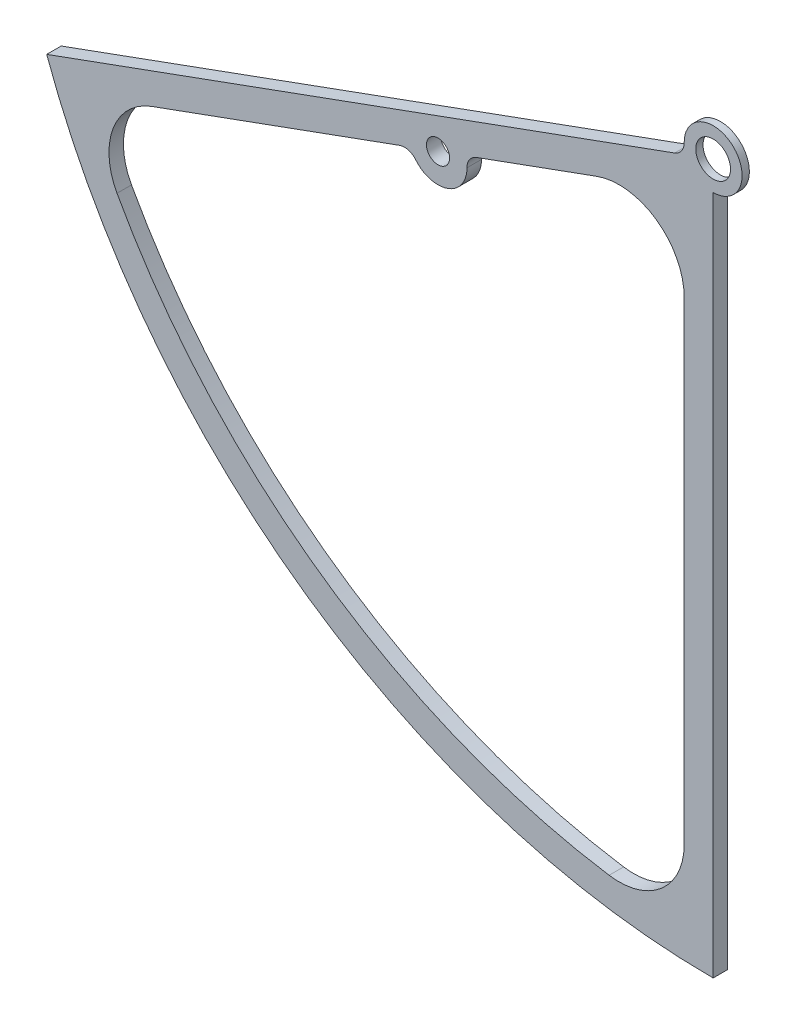
ISO-10303-21;
HEADER;
FILE_DESCRIPTION(('STEP AP214'),'2;1');
FILE_NAME('part.step','',(''),(''),'','','');
FILE_SCHEMA(('AUTOMOTIVE_DESIGN { 1 0 10303 214 1 1 1 1 }'));
ENDSEC;
DATA;
#1=APPLICATION_CONTEXT('core data for automotive mechanical design processes');
#2=APPLICATION_PROTOCOL_DEFINITION('international standard','automotive_design',2000,#1);
#3=PRODUCT_CONTEXT('',#1,'mechanical');
#4=PRODUCT('Part','Part','',(#3));
#5=PRODUCT_RELATED_PRODUCT_CATEGORY('part','',(#4));
#6=PRODUCT_DEFINITION_FORMATION('','',#4);
#7=PRODUCT_DEFINITION_CONTEXT('part definition',#1,'design');
#8=PRODUCT_DEFINITION('design','',#6,#7);
#9=PRODUCT_DEFINITION_SHAPE('','',#8);
#10=(LENGTH_UNIT() NAMED_UNIT(*) SI_UNIT(.MILLI.,.METRE.));
#11=(NAMED_UNIT(*) PLANE_ANGLE_UNIT() SI_UNIT($,.RADIAN.));
#12=(NAMED_UNIT(*) SI_UNIT($,.STERADIAN.) SOLID_ANGLE_UNIT());
#13=UNCERTAINTY_MEASURE_WITH_UNIT(LENGTH_MEASURE(1.E-05),#10,'distance_accuracy_value','');
#14=(GEOMETRIC_REPRESENTATION_CONTEXT(3) GLOBAL_UNCERTAINTY_ASSIGNED_CONTEXT((#13)) GLOBAL_UNIT_ASSIGNED_CONTEXT((#10,
#11,#12)) REPRESENTATION_CONTEXT('',''));
#15=CARTESIAN_POINT('',(0.,0.,0.));
#16=DIRECTION('',(0.,0.,1.));
#17=DIRECTION('',(1.,0.,0.));
#18=AXIS2_PLACEMENT_3D('',#15,#16,#17);
#19=CARTESIAN_POINT('',(0.,0.,10.));
#20=DIRECTION('',(0.,0.,-1.));
#21=DIRECTION('',(-1.,0.,0.));
#22=AXIS2_PLACEMENT_3D('',#19,#20,#21);
#23=CYLINDRICAL_SURFACE('',#22,20.);
#24=CARTESIAN_POINT('',(0.,0.,5.));
#25=DIRECTION('',(0.,0.,-1.));
#26=DIRECTION('',(-1.,0.,0.));
#27=AXIS2_PLACEMENT_3D('',#24,#25,#26);
#28=CIRCLE('',#27,20.);
#29=CARTESIAN_POINT('',(-19.9991482725358,-0.184576198706586,5.));
#30=VERTEX_POINT('',#29);
#31=CARTESIAN_POINT('',(0.,-20.,5.));
#32=VERTEX_POINT('',#31);
#33=EDGE_CURVE('E177',#30,#32,#28,.T.);
#34=ORIENTED_EDGE('',*,*,#33,.F.);
#35=DIRECTION('',(0.,0.,-1.));
#36=VECTOR('',#35,1.);
#37=CARTESIAN_POINT('',(-19.9991482725358,-0.184576198706586,10.));
#38=LINE('',#37,#36);
#39=CARTESIAN_POINT('',(-19.9991482725358,-0.184576198706586,10.));
#40=VERTEX_POINT('',#39);
#41=EDGE_CURVE('E257',#30,#40,#38,.F.);
#42=ORIENTED_EDGE('',*,*,#41,.T.);
#43=CARTESIAN_POINT('',(0.,0.,10.));
#44=DIRECTION('',(0.,0.,1.));
#45=DIRECTION('',(1.,0.,0.));
#46=AXIS2_PLACEMENT_3D('',#43,#44,#45);
#47=CIRCLE('',#46,20.);
#48=CARTESIAN_POINT('',(0.,-20.,10.));
#49=VERTEX_POINT('',#48);
#50=EDGE_CURVE('E287',#49,#40,#47,.T.);
#51=ORIENTED_EDGE('',*,*,#50,.F.);
#52=DIRECTION('',(0.,0.,-1.));
#53=VECTOR('',#52,1.);
#54=CARTESIAN_POINT('',(0.,-20.,10.));
#55=LINE('',#54,#53);
#56=EDGE_CURVE('E202',#49,#32,#55,.T.);
#57=ORIENTED_EDGE('',*,*,#56,.T.);
#58=EDGE_LOOP('',(#34,#42,#51,#57));
#59=FACE_BOUND('',#58,.T.);
#60=ADVANCED_FACE('F38',(#59),#23,.T.);
#61=CARTESIAN_POINT('',(0.,0.,10.));
#62=DIRECTION('',(0.,0.,-1.));
#63=DIRECTION('',(-1.,0.,0.));
#64=AXIS2_PLACEMENT_3D('',#61,#62,#63);
#65=CYLINDRICAL_SURFACE('',#64,12.);
#66=CARTESIAN_POINT('',(0.,0.,10.));
#67=DIRECTION('',(0.,0.,1.));
#68=DIRECTION('',(1.,0.,0.));
#69=AXIS2_PLACEMENT_3D('',#66,#67,#68);
#70=CIRCLE('',#69,12.);
#71=CARTESIAN_POINT('',(12.,0.,10.));
#72=VERTEX_POINT('',#71);
#73=EDGE_CURVE('E190',#72,#72,#70,.T.);
#74=ORIENTED_EDGE('',*,*,#73,.T.);
#75=EDGE_LOOP('',(#74));
#76=FACE_BOUND('',#75,.T.);
#77=CARTESIAN_POINT('',(0.,0.,5.));
#78=DIRECTION('',(0.,0.,-1.));
#79=DIRECTION('',(-1.,0.,0.));
#80=AXIS2_PLACEMENT_3D('',#77,#78,#79);
#81=CIRCLE('',#80,12.);
#82=CARTESIAN_POINT('',(-12.,0.,5.));
#83=VERTEX_POINT('',#82);
#84=EDGE_CURVE('E167',#83,#83,#81,.T.);
#85=ORIENTED_EDGE('',*,*,#84,.T.);
#86=EDGE_LOOP('',(#85));
#87=FACE_BOUND('',#86,.T.);
#88=ADVANCED_FACE('F378',(#76,#87),#65,.F.);
#89=CARTESIAN_POINT('',(0.,0.,10.));
#90=DIRECTION('',(0.,0.,1.));
#91=DIRECTION('',(1.,0.,0.));
#92=AXIS2_PLACEMENT_3D('',#89,#90,#91);
#93=PLANE('',#92);
#94=DIRECTION('',(0.,1.,0.));
#95=VECTOR('',#94,1.);
#96=CARTESIAN_POINT('',(-20.0000000000001,-28.5629601348423,10.));
#97=LINE('',#96,#95);
#98=CARTESIAN_POINT('',(-20.0000000000001,-420.,10.));
#99=VERTEX_POINT('',#98);
#100=CARTESIAN_POINT('',(-20.0000000000001,-92.8296204382372,10.));
#101=VERTEX_POINT('',#100);
#102=EDGE_CURVE('E333',#99,#101,#97,.T.);
#103=ORIENTED_EDGE('',*,*,#102,.F.);
#104=CARTESIAN_POINT('',(-65.0000000000001,-420.,10.));
#105=DIRECTION('',(0.,0.,1.));
#106=DIRECTION('',(1.,0.,0.));
#107=AXIS2_PLACEMENT_3D('',#104,#105,#106);
#108=CIRCLE('',#107,45.);
#109=CARTESIAN_POINT('',(-71.8823529411765,-464.470588235294,10.));
#110=VERTEX_POINT('',#109);
#111=EDGE_CURVE('E234',#99,#110,#108,.F.);
#112=ORIENTED_EDGE('',*,*,#111,.T.);
#113=CARTESIAN_POINT('',(0.,0.,10.));
#114=DIRECTION('',(0.,0.,1.));
#115=DIRECTION('',(1.,0.,0.));
#116=AXIS2_PLACEMENT_3D('',#113,#114,#115);
#117=CIRCLE('',#116,470.);
#118=CARTESIAN_POINT('',(-411.874371681269,-226.405613782344,10.));
#119=VERTEX_POINT('',#118);
#120=EDGE_CURVE('E306',#119,#110,#117,.T.);
#121=ORIENTED_EDGE('',*,*,#120,.F.);
#122=CARTESIAN_POINT('',(-372.439591413914,-204.728480547864,10.));
#123=DIRECTION('',(0.,0.,1.));
#124=DIRECTION('',(1.,0.,0.));
#125=AXIS2_PLACEMENT_3D('',#122,#123,#124);
#126=CIRCLE('',#125,45.);
#127=CARTESIAN_POINT('',(-387.830497863568,-162.442312612498,10.));
#128=VERTEX_POINT('',#127);
#129=EDGE_CURVE('E246',#119,#128,#126,.F.);
#130=ORIENTED_EDGE('',*,*,#129,.T.);
#131=DIRECTION('',(-0.939692620785909,-0.342020143325666,0.));
#132=VECTOR('',#131,1.);
#133=CARTESIAN_POINT('',(-208.888849531636,-97.3128789491445,10.));
#134=LINE('',#133,#132);
#135=CARTESIAN_POINT('',(-216.673518091464,-100.14626658855,10.));
#136=VERTEX_POINT('',#135);
#137=EDGE_CURVE('E302',#136,#128,#134,.T.);
#138=ORIENTED_EDGE('',*,*,#137,.F.);
#139=CARTESIAN_POINT('',(-213.253316658208,-109.543192796409,10.));
#140=DIRECTION('',(0.,0.,1.));
#141=DIRECTION('',(1.,0.,0.));
#142=AXIS2_PLACEMENT_3D('',#139,#140,#141);
#143=CIRCLE('',#142,10.);
#144=CARTESIAN_POINT('',(-205.533876810778,-103.18628722515,10.));
#145=VERTEX_POINT('',#144);
#146=EDGE_CURVE('E11',#136,#145,#143,.F.);
#147=ORIENTED_EDGE('',*,*,#146,.T.);
#148=CARTESIAN_POINT('',(-190.094997115917,-90.4724760826312,10.));
#149=DIRECTION('',(0.,0.,-1.));
#150=DIRECTION('',(1.,0.,0.));
#151=AXIS2_PLACEMENT_3D('',#148,#149,#150);
#152=CIRCLE('',#151,20.);
#153=CARTESIAN_POINT('',(-170.095848843382,-90.2878998839246,10.));
#154=VERTEX_POINT('',#153);
#155=EDGE_CURVE('E325',#154,#145,#152,.T.);
#156=ORIENTED_EDGE('',*,*,#155,.F.);
#157=CARTESIAN_POINT('',(-160.096274707114,-90.1956117845713,10.));
#158=DIRECTION('',(0.,0.,1.));
#159=DIRECTION('',(1.,0.,0.));
#160=AXIS2_PLACEMENT_3D('',#157,#158,#159);
#161=CIRCLE('',#160,10.);
#162=CARTESIAN_POINT('',(-163.51647614037,-80.7986855767122,10.));
#163=VERTEX_POINT('',#162);
#164=EDGE_CURVE('E282',#154,#163,#161,.F.);
#165=ORIENTED_EDGE('',*,*,#164,.T.);
#166=DIRECTION('',(-0.939692620785909,-0.342020143325666,0.));
#167=VECTOR('',#166,1.);
#168=CARTESIAN_POINT('',(-20.0000000000001,-28.5629601348423,10.));
#169=LINE('',#168,#167);
#170=CARTESIAN_POINT('',(-80.390906449655,-50.5434525028713,10.));
#171=VERTEX_POINT('',#170);
#172=EDGE_CURVE('E329',#171,#163,#169,.T.);
#173=ORIENTED_EDGE('',*,*,#172,.F.);
#174=CARTESIAN_POINT('',(-65.0000000000001,-92.8296204382372,10.));
#175=DIRECTION('',(0.,0.,1.));
#176=DIRECTION('',(1.,0.,0.));
#177=AXIS2_PLACEMENT_3D('',#174,#175,#176);
#178=CIRCLE('',#177,45.);
#179=EDGE_CURVE('E240',#171,#101,#178,.F.);
#180=ORIENTED_EDGE('',*,*,#179,.T.);
#181=EDGE_LOOP('',(#103,#112,#121,#130,#138,#147,#156,#165,#173,#180));
#182=FACE_BOUND('',#181,.T.);
#183=ORIENTED_EDGE('',*,*,#73,.F.);
#184=EDGE_LOOP('',(#183));
#185=FACE_BOUND('',#184,.T.);
#186=CARTESIAN_POINT('',(0.,0.,10.));
#187=DIRECTION('',(0.,0.,1.));
#188=DIRECTION('',(1.,0.,0.));
#189=AXIS2_PLACEMENT_3D('',#186,#187,#188);
#190=CIRCLE('',#189,490.);
#191=CARTESIAN_POINT('',(-460.449384185096,-167.589870229576,10.));
#192=VERTEX_POINT('',#191);
#193=CARTESIAN_POINT('',(0.,-490.,10.));
#194=VERTEX_POINT('',#193);
#195=EDGE_CURVE('E188',#192,#194,#190,.T.);
#196=ORIENTED_EDGE('',*,*,#195,.T.);
#197=DIRECTION('',(0.,1.,0.));
#198=VECTOR('',#197,1.);
#199=CARTESIAN_POINT('',(0.,-20.,10.));
#200=LINE('',#199,#198);
#201=EDGE_CURVE('E290',#194,#49,#200,.T.);
#202=ORIENTED_EDGE('',*,*,#201,.T.);
#203=ORIENTED_EDGE('',*,*,#50,.T.);
#204=CARTESIAN_POINT('',(-29.9987224088037,-0.276864298059879,10.));
#205=DIRECTION('',(0.,0.,1.));
#206=DIRECTION('',(1.,0.,0.));
#207=AXIS2_PLACEMENT_3D('',#204,#205,#206);
#208=CIRCLE('',#207,10.);
#209=CARTESIAN_POINT('',(-26.578520975547,-9.67379050591897,10.));
#210=VERTEX_POINT('',#209);
#211=EDGE_CURVE('E276',#40,#210,#208,.F.);
#212=ORIENTED_EDGE('',*,*,#211,.T.);
#213=DIRECTION('',(-0.939692620785909,-0.342020143325666,0.));
#214=VECTOR('',#213,1.);
#215=CARTESIAN_POINT('',(-18.7938524157182,-6.84040286651335,10.));
#216=LINE('',#215,#214);
#217=EDGE_CURVE('E199',#210,#192,#216,.T.);
#218=ORIENTED_EDGE('',*,*,#217,.T.);
#219=EDGE_LOOP('',(#196,#202,#203,#212,#218));
#220=FACE_BOUND('',#219,.T.);
#221=CARTESIAN_POINT('',(-190.094997115917,-90.4724760826312,10.));
#222=DIRECTION('',(0.,0.,1.));
#223=DIRECTION('',(1.,0.,0.));
#224=AXIS2_PLACEMENT_3D('',#221,#222,#223);
#225=CIRCLE('',#224,8.00000000000001);
#226=CARTESIAN_POINT('',(-182.094997115917,-90.4724760826312,10.));
#227=VERTEX_POINT('',#226);
#228=EDGE_CURVE('E322',#227,#227,#225,.T.);
#229=ORIENTED_EDGE('',*,*,#228,.F.);
#230=EDGE_LOOP('',(#229));
#231=FACE_BOUND('',#230,.T.);
#232=ADVANCED_FACE('F360',(#182,#185,#220,#231),#93,.T.);
#233=CARTESIAN_POINT('',(0.,0.,0.));
#234=DIRECTION('',(0.,0.,1.));
#235=DIRECTION('',(1.,0.,0.));
#236=AXIS2_PLACEMENT_3D('',#233,#234,#235);
#237=PLANE('',#236);
#238=DIRECTION('',(-0.939692620785909,-0.342020143325666,0.));
#239=VECTOR('',#238,1.);
#240=CARTESIAN_POINT('',(-18.7938524157182,-6.84040286651335,0.));
#241=LINE('',#240,#239);
#242=CARTESIAN_POINT('',(-18.7938524157182,-6.84040286651336,0.));
#243=VERTEX_POINT('',#242);
#244=CARTESIAN_POINT('',(-460.449384185096,-167.589870229576,0.));
#245=VERTEX_POINT('',#244);
#246=EDGE_CURVE('E175',#243,#245,#241,.T.);
#247=ORIENTED_EDGE('',*,*,#246,.F.);
#248=CARTESIAN_POINT('',(0.,0.,0.));
#249=DIRECTION('',(0.,0.,-1.));
#250=DIRECTION('',(-1.,0.,0.));
#251=AXIS2_PLACEMENT_3D('',#248,#249,#250);
#252=CIRCLE('',#251,20.);
#253=CARTESIAN_POINT('',(0.,-20.,0.));
#254=VERTEX_POINT('',#253);
#255=EDGE_CURVE('E157',#254,#243,#252,.T.);
#256=ORIENTED_EDGE('',*,*,#255,.F.);
#257=DIRECTION('',(0.,1.,0.));
#258=VECTOR('',#257,1.);
#259=CARTESIAN_POINT('',(0.,-20.,0.));
#260=LINE('',#259,#258);
#261=CARTESIAN_POINT('',(0.,-490.,0.));
#262=VERTEX_POINT('',#261);
#263=EDGE_CURVE('E173',#262,#254,#260,.T.);
#264=ORIENTED_EDGE('',*,*,#263,.F.);
#265=CARTESIAN_POINT('',(0.,0.,0.));
#266=DIRECTION('',(0.,0.,1.));
#267=DIRECTION('',(1.,0.,0.));
#268=AXIS2_PLACEMENT_3D('',#265,#266,#267);
#269=CIRCLE('',#268,490.);
#270=EDGE_CURVE('E184',#245,#262,#269,.T.);
#271=ORIENTED_EDGE('',*,*,#270,.F.);
#272=EDGE_LOOP('',(#247,#256,#264,#271));
#273=FACE_BOUND('',#272,.T.);
#274=CARTESIAN_POINT('',(-190.094997115917,-90.4724760826312,0.));
#275=DIRECTION('',(0.,0.,-1.));
#276=DIRECTION('',(1.,0.,0.));
#277=AXIS2_PLACEMENT_3D('',#274,#275,#276);
#278=CIRCLE('',#277,20.);
#279=CARTESIAN_POINT('',(-170.095848843382,-90.2878998839246,0.));
#280=VERTEX_POINT('',#279);
#281=CARTESIAN_POINT('',(-205.533876810778,-103.18628722515,0.));
#282=VERTEX_POINT('',#281);
#283=EDGE_CURVE('E307',#280,#282,#278,.T.);
#284=ORIENTED_EDGE('',*,*,#283,.T.);
#285=CARTESIAN_POINT('',(-213.253316658208,-109.543192796409,0.));
#286=DIRECTION('',(0.,0.,1.));
#287=DIRECTION('',(1.,0.,0.));
#288=AXIS2_PLACEMENT_3D('',#285,#286,#287);
#289=CIRCLE('',#288,10.);
#290=CARTESIAN_POINT('',(-216.673518091464,-100.14626658855,0.));
#291=VERTEX_POINT('',#290);
#292=EDGE_CURVE('E47',#282,#291,#289,.T.);
#293=ORIENTED_EDGE('',*,*,#292,.T.);
#294=DIRECTION('',(-0.939692620785909,-0.342020143325666,0.));
#295=VECTOR('',#294,1.);
#296=CARTESIAN_POINT('',(-208.888849531636,-97.3128789491445,0.));
#297=LINE('',#296,#295);
#298=CARTESIAN_POINT('',(-387.830497863568,-162.442312612498,0.));
#299=VERTEX_POINT('',#298);
#300=EDGE_CURVE('E303',#291,#299,#297,.T.);
#301=ORIENTED_EDGE('',*,*,#300,.T.);
#302=CARTESIAN_POINT('',(-372.439591413914,-204.728480547864,0.));
#303=DIRECTION('',(0.,0.,1.));
#304=DIRECTION('',(1.,0.,0.));
#305=AXIS2_PLACEMENT_3D('',#302,#303,#304);
#306=CIRCLE('',#305,45.);
#307=CARTESIAN_POINT('',(-411.874371681269,-226.405613782344,0.));
#308=VERTEX_POINT('',#307);
#309=EDGE_CURVE('E243',#299,#308,#306,.T.);
#310=ORIENTED_EDGE('',*,*,#309,.T.);
#311=CARTESIAN_POINT('',(0.,0.,0.));
#312=DIRECTION('',(0.,0.,1.));
#313=DIRECTION('',(1.,0.,0.));
#314=AXIS2_PLACEMENT_3D('',#311,#312,#313);
#315=CIRCLE('',#314,470.);
#316=CARTESIAN_POINT('',(-71.8823529411765,-464.470588235294,0.));
#317=VERTEX_POINT('',#316);
#318=EDGE_CURVE('E318',#308,#317,#315,.T.);
#319=ORIENTED_EDGE('',*,*,#318,.T.);
#320=CARTESIAN_POINT('',(-65.0000000000001,-420.,0.));
#321=DIRECTION('',(0.,0.,1.));
#322=DIRECTION('',(1.,0.,0.));
#323=AXIS2_PLACEMENT_3D('',#320,#321,#322);
#324=CIRCLE('',#323,45.);
#325=CARTESIAN_POINT('',(-20.0000000000001,-420.,0.));
#326=VERTEX_POINT('',#325);
#327=EDGE_CURVE('E231',#317,#326,#324,.T.);
#328=ORIENTED_EDGE('',*,*,#327,.T.);
#329=DIRECTION('',(0.,1.,0.));
#330=VECTOR('',#329,1.);
#331=CARTESIAN_POINT('',(-20.0000000000001,-28.5629601348423,0.));
#332=LINE('',#331,#330);
#333=CARTESIAN_POINT('',(-20.0000000000001,-92.8296204382372,0.));
#334=VERTEX_POINT('',#333);
#335=EDGE_CURVE('E314',#326,#334,#332,.T.);
#336=ORIENTED_EDGE('',*,*,#335,.T.);
#337=CARTESIAN_POINT('',(-65.0000000000001,-92.8296204382372,0.));
#338=DIRECTION('',(0.,0.,1.));
#339=DIRECTION('',(1.,0.,0.));
#340=AXIS2_PLACEMENT_3D('',#337,#338,#339);
#341=CIRCLE('',#340,45.);
#342=CARTESIAN_POINT('',(-80.390906449655,-50.5434525028713,0.));
#343=VERTEX_POINT('',#342);
#344=EDGE_CURVE('E237',#334,#343,#341,.T.);
#345=ORIENTED_EDGE('',*,*,#344,.T.);
#346=DIRECTION('',(-0.939692620785909,-0.342020143325666,0.));
#347=VECTOR('',#346,1.);
#348=CARTESIAN_POINT('',(-20.0000000000001,-28.5629601348423,0.));
#349=LINE('',#348,#347);
#350=CARTESIAN_POINT('',(-163.51647614037,-80.7986855767122,0.));
#351=VERTEX_POINT('',#350);
#352=EDGE_CURVE('E310',#343,#351,#349,.T.);
#353=ORIENTED_EDGE('',*,*,#352,.T.);
#354=CARTESIAN_POINT('',(-160.096274707114,-90.1956117845713,0.));
#355=DIRECTION('',(0.,0.,1.));
#356=DIRECTION('',(1.,0.,0.));
#357=AXIS2_PLACEMENT_3D('',#354,#355,#356);
#358=CIRCLE('',#357,10.);
#359=EDGE_CURVE('E279',#351,#280,#358,.T.);
#360=ORIENTED_EDGE('',*,*,#359,.T.);
#361=EDGE_LOOP('',(#284,#293,#301,#310,#319,#328,#336,#345,#353,#360));
#362=FACE_BOUND('',#361,.T.);
#363=CARTESIAN_POINT('',(-190.094997115917,-90.4724760826312,0.));
#364=DIRECTION('',(0.,0.,1.));
#365=DIRECTION('',(1.,0.,0.));
#366=AXIS2_PLACEMENT_3D('',#363,#364,#365);
#367=CIRCLE('',#366,8.00000000000001);
#368=CARTESIAN_POINT('',(-182.094997115917,-90.4724760826312,0.));
#369=VERTEX_POINT('',#368);
#370=EDGE_CURVE('E166',#369,#369,#367,.T.);
#371=ORIENTED_EDGE('',*,*,#370,.T.);
#372=EDGE_LOOP('',(#371));
#373=FACE_BOUND('',#372,.T.);
#374=ADVANCED_FACE('F171',(#273,#362,#373),#237,.F.);
#375=CARTESIAN_POINT('',(0.,0.,10.));
#376=DIRECTION('',(0.,0.,-1.));
#377=DIRECTION('',(-1.,0.,0.));
#378=AXIS2_PLACEMENT_3D('',#375,#376,#377);
#379=CYLINDRICAL_SURFACE('',#378,490.);
#380=ORIENTED_EDGE('',*,*,#270,.T.);
#381=DIRECTION('',(0.,0.,-1.));
#382=VECTOR('',#381,1.);
#383=CARTESIAN_POINT('',(0.,-490.,10.));
#384=LINE('',#383,#382);
#385=EDGE_CURVE('E181',#194,#262,#384,.T.);
#386=ORIENTED_EDGE('',*,*,#385,.F.);
#387=ORIENTED_EDGE('',*,*,#195,.F.);
#388=DIRECTION('',(0.,0.,-1.));
#389=VECTOR('',#388,1.);
#390=CARTESIAN_POINT('',(-460.449384185096,-167.589870229576,10.));
#391=LINE('',#390,#389);
#392=EDGE_CURVE('E194',#192,#245,#391,.T.);
#393=ORIENTED_EDGE('',*,*,#392,.T.);
#394=EDGE_LOOP('',(#380,#386,#387,#393));
#395=FACE_BOUND('',#394,.T.);
#396=ADVANCED_FACE('F366',(#395),#379,.T.);
#397=CARTESIAN_POINT('',(0.,-20.,10.));
#398=DIRECTION('',(-1.,0.,0.));
#399=DIRECTION('',(0.,-1.,0.));
#400=AXIS2_PLACEMENT_3D('',#397,#398,#399);
#401=PLANE('',#400);
#402=ORIENTED_EDGE('',*,*,#263,.T.);
#403=DIRECTION('',(0.,0.,-1.));
#404=VECTOR('',#403,1.);
#405=CARTESIAN_POINT('',(0.,-20.,5.));
#406=LINE('',#405,#404);
#407=EDGE_CURVE('E153',#254,#32,#406,.F.);
#408=ORIENTED_EDGE('',*,*,#407,.T.);
#409=ORIENTED_EDGE('',*,*,#56,.F.);
#410=ORIENTED_EDGE('',*,*,#201,.F.);
#411=ORIENTED_EDGE('',*,*,#385,.T.);
#412=EDGE_LOOP('',(#402,#408,#409,#410,#411));
#413=FACE_BOUND('',#412,.T.);
#414=ADVANCED_FACE('F179',(#413),#401,.F.);
#415=CARTESIAN_POINT('',(-18.7938524157182,-6.84040286651335,10.));
#416=DIRECTION('',(0.342020143325666,-0.939692620785909,0.));
#417=DIRECTION('',(0.939692620785909,0.342020143325666,0.));
#418=AXIS2_PLACEMENT_3D('',#415,#416,#417);
#419=PLANE('',#418);
#420=ORIENTED_EDGE('',*,*,#217,.F.);
#421=DIRECTION('',(0.,0.,1.));
#422=VECTOR('',#421,1.);
#423=CARTESIAN_POINT('',(-26.578520975547,-9.67379050591897,5.));
#424=LINE('',#423,#422);
#425=CARTESIAN_POINT('',(-26.578520975547,-9.67379050591897,5.));
#426=VERTEX_POINT('',#425);
#427=EDGE_CURVE('E253',#210,#426,#424,.F.);
#428=ORIENTED_EDGE('',*,*,#427,.T.);
#429=DIRECTION('',(0.939692620785909,0.342020143325666,0.));
#430=VECTOR('',#429,1.);
#431=CARTESIAN_POINT('',(-18.7938524157182,-6.84040286651335,5.));
#432=LINE('',#431,#430);
#433=CARTESIAN_POINT('',(-18.7938524157182,-6.84040286651335,5.));
#434=VERTEX_POINT('',#433);
#435=EDGE_CURVE('E250',#426,#434,#432,.T.);
#436=ORIENTED_EDGE('',*,*,#435,.T.);
#437=DIRECTION('',(0.,0.,-1.));
#438=VECTOR('',#437,1.);
#439=CARTESIAN_POINT('',(-18.7938524157182,-6.84040286651336,10.));
#440=LINE('',#439,#438);
#441=EDGE_CURVE('E198',#434,#243,#440,.T.);
#442=ORIENTED_EDGE('',*,*,#441,.T.);
#443=ORIENTED_EDGE('',*,*,#246,.T.);
#444=ORIENTED_EDGE('',*,*,#392,.F.);
#445=EDGE_LOOP('',(#420,#428,#436,#442,#443,#444));
#446=FACE_BOUND('',#445,.T.);
#447=ADVANCED_FACE('F364',(#446),#419,.F.);
#448=CARTESIAN_POINT('',(0.,0.,10.));
#449=DIRECTION('',(0.,0.,-1.));
#450=DIRECTION('',(-1.,0.,0.));
#451=AXIS2_PLACEMENT_3D('',#448,#449,#450);
#452=CYLINDRICAL_SURFACE('',#451,470.);
#453=ORIENTED_EDGE('',*,*,#120,.T.);
#454=DIRECTION('',(0.,0.,-1.));
#455=VECTOR('',#454,1.);
#456=CARTESIAN_POINT('',(-71.8823529411765,-464.470588235294,10.));
#457=LINE('',#456,#455);
#458=EDGE_CURVE('E213',#110,#317,#457,.T.);
#459=ORIENTED_EDGE('',*,*,#458,.T.);
#460=ORIENTED_EDGE('',*,*,#318,.F.);
#461=DIRECTION('',(0.,0.,-1.));
#462=VECTOR('',#461,1.);
#463=CARTESIAN_POINT('',(-411.874371681269,-226.405613782344,10.));
#464=LINE('',#463,#462);
#465=EDGE_CURVE('E207',#308,#119,#464,.F.);
#466=ORIENTED_EDGE('',*,*,#465,.T.);
#467=EDGE_LOOP('',(#453,#459,#460,#466));
#468=FACE_BOUND('',#467,.T.);
#469=ADVANCED_FACE('F389',(#468),#452,.F.);
#470=CARTESIAN_POINT('',(-20.0000000000001,-28.5629601348423,10.));
#471=DIRECTION('',(-1.,0.,0.));
#472=DIRECTION('',(0.,0.,1.));
#473=AXIS2_PLACEMENT_3D('',#470,#471,#472);
#474=PLANE('',#473);
#475=ORIENTED_EDGE('',*,*,#335,.F.);
#476=DIRECTION('',(0.,0.,1.));
#477=VECTOR('',#476,1.);
#478=CARTESIAN_POINT('',(-20.0000000000001,-420.,10.));
#479=LINE('',#478,#477);
#480=EDGE_CURVE('E221',#326,#99,#479,.T.);
#481=ORIENTED_EDGE('',*,*,#480,.T.);
#482=ORIENTED_EDGE('',*,*,#102,.T.);
#483=DIRECTION('',(0.,0.,-1.));
#484=VECTOR('',#483,1.);
#485=CARTESIAN_POINT('',(-20.0000000000001,-92.8296204382372,0.));
#486=LINE('',#485,#484);
#487=EDGE_CURVE('E217',#101,#334,#486,.T.);
#488=ORIENTED_EDGE('',*,*,#487,.T.);
#489=EDGE_LOOP('',(#475,#481,#482,#488));
#490=FACE_BOUND('',#489,.T.);
#491=ADVANCED_FACE('F395',(#490),#474,.T.);
#492=CARTESIAN_POINT('',(-20.0000000000001,-28.5629601348423,10.));
#493=DIRECTION('',(0.342020143325666,-0.939692620785909,0.));
#494=DIRECTION('',(0.939692620785909,0.342020143325666,0.));
#495=AXIS2_PLACEMENT_3D('',#492,#493,#494);
#496=PLANE('',#495);
#497=ORIENTED_EDGE('',*,*,#172,.T.);
#498=DIRECTION('',(0.,0.,1.));
#499=VECTOR('',#498,1.);
#500=CARTESIAN_POINT('',(-163.51647614037,-80.7986855767122,0.));
#501=LINE('',#500,#499);
#502=EDGE_CURVE('E260',#163,#351,#501,.F.);
#503=ORIENTED_EDGE('',*,*,#502,.T.);
#504=ORIENTED_EDGE('',*,*,#352,.F.);
#505=DIRECTION('',(0.,0.,-1.));
#506=VECTOR('',#505,1.);
#507=CARTESIAN_POINT('',(-80.390906449655,-50.5434525028713,10.));
#508=LINE('',#507,#506);
#509=EDGE_CURVE('E224',#343,#171,#508,.F.);
#510=ORIENTED_EDGE('',*,*,#509,.T.);
#511=EDGE_LOOP('',(#497,#503,#504,#510));
#512=FACE_BOUND('',#511,.T.);
#513=ADVANCED_FACE('F399',(#512),#496,.T.);
#514=CARTESIAN_POINT('',(-190.094997115917,-90.4724760826312,10.));
#515=DIRECTION('',(0.,0.,-1.));
#516=DIRECTION('',(-1.,0.,0.));
#517=AXIS2_PLACEMENT_3D('',#514,#515,#516);
#518=CYLINDRICAL_SURFACE('',#517,20.);
#519=ORIENTED_EDGE('',*,*,#283,.F.);
#520=DIRECTION('',(0.,0.,-1.));
#521=VECTOR('',#520,1.);
#522=CARTESIAN_POINT('',(-170.095848843382,-90.2878998839246,10.));
#523=LINE('',#522,#521);
#524=EDGE_CURVE('E268',#280,#154,#523,.F.);
#525=ORIENTED_EDGE('',*,*,#524,.T.);
#526=ORIENTED_EDGE('',*,*,#155,.T.);
#527=DIRECTION('',(0.,0.,-1.));
#528=VECTOR('',#527,1.);
#529=CARTESIAN_POINT('',(-205.533876810778,-103.18628722515,10.));
#530=LINE('',#529,#528);
#531=EDGE_CURVE('E264',#145,#282,#530,.T.);
#532=ORIENTED_EDGE('',*,*,#531,.T.);
#533=EDGE_LOOP('',(#519,#525,#526,#532));
#534=FACE_BOUND('',#533,.T.);
#535=ADVANCED_FACE('F403',(#534),#518,.T.);
#536=CARTESIAN_POINT('',(-208.888849531636,-97.3128789491445,10.));
#537=DIRECTION('',(0.342020143325666,-0.939692620785909,0.));
#538=DIRECTION('',(0.939692620785909,0.342020143325666,0.));
#539=AXIS2_PLACEMENT_3D('',#536,#537,#538);
#540=PLANE('',#539);
#541=ORIENTED_EDGE('',*,*,#300,.F.);
#542=DIRECTION('',(0.,0.,1.));
#543=VECTOR('',#542,1.);
#544=CARTESIAN_POINT('',(-216.673518091464,-100.14626658855,10.));
#545=LINE('',#544,#543);
#546=EDGE_CURVE('E60',#291,#136,#545,.T.);
#547=ORIENTED_EDGE('',*,*,#546,.T.);
#548=ORIENTED_EDGE('',*,*,#137,.T.);
#549=DIRECTION('',(0.,0.,1.));
#550=VECTOR('',#549,1.);
#551=CARTESIAN_POINT('',(-387.830497863569,-162.442312612498,0.));
#552=LINE('',#551,#550);
#553=EDGE_CURVE('E227',#128,#299,#552,.F.);
#554=ORIENTED_EDGE('',*,*,#553,.T.);
#555=EDGE_LOOP('',(#541,#547,#548,#554));
#556=FACE_BOUND('',#555,.T.);
#557=ADVANCED_FACE('F407',(#556),#540,.T.);
#558=CARTESIAN_POINT('',(-190.094997115917,-90.4724760826312,10.));
#559=DIRECTION('',(0.,0.,-1.));
#560=DIRECTION('',(-1.,0.,0.));
#561=AXIS2_PLACEMENT_3D('',#558,#559,#560);
#562=CYLINDRICAL_SURFACE('',#561,8.00000000000001);
#563=ORIENTED_EDGE('',*,*,#228,.T.);
#564=EDGE_LOOP('',(#563));
#565=FACE_BOUND('',#564,.T.);
#566=ORIENTED_EDGE('',*,*,#370,.F.);
#567=EDGE_LOOP('',(#566));
#568=FACE_BOUND('',#567,.T.);
#569=ADVANCED_FACE('F411',(#565,#568),#562,.F.);
#570=CARTESIAN_POINT('',(0.,0.,5.));
#571=DIRECTION('',(0.,0.,-1.));
#572=DIRECTION('',(-1.,0.,0.));
#573=AXIS2_PLACEMENT_3D('',#570,#571,#572);
#574=CYLINDRICAL_SURFACE('',#573,20.);
#575=ORIENTED_EDGE('',*,*,#255,.T.);
#576=ORIENTED_EDGE('',*,*,#441,.F.);
#577=EDGE_CURVE('E160',#32,#434,#28,.T.);
#578=ORIENTED_EDGE('',*,*,#577,.F.);
#579=ORIENTED_EDGE('',*,*,#407,.F.);
#580=EDGE_LOOP('',(#575,#576,#578,#579));
#581=FACE_BOUND('',#580,.T.);
#582=ADVANCED_FACE('F155',(#581),#574,.F.);
#583=CARTESIAN_POINT('',(0.,0.,5.));
#584=DIRECTION('',(0.,0.,-1.));
#585=DIRECTION('',(-1.,0.,0.));
#586=AXIS2_PLACEMENT_3D('',#583,#584,#585);
#587=PLANE('',#586);
#588=ORIENTED_EDGE('',*,*,#84,.F.);
#589=EDGE_LOOP('',(#588));
#590=FACE_BOUND('',#589,.T.);
#591=ORIENTED_EDGE('',*,*,#577,.T.);
#592=ORIENTED_EDGE('',*,*,#435,.F.);
#593=CARTESIAN_POINT('',(-29.9987224088037,-0.276864298059879,5.));
#594=DIRECTION('',(0.,0.,-1.));
#595=DIRECTION('',(-1.,0.,0.));
#596=AXIS2_PLACEMENT_3D('',#593,#594,#595);
#597=CIRCLE('',#596,10.);
#598=EDGE_CURVE('E273',#426,#30,#597,.F.);
#599=ORIENTED_EDGE('',*,*,#598,.T.);
#600=ORIENTED_EDGE('',*,*,#33,.T.);
#601=EDGE_LOOP('',(#591,#592,#599,#600));
#602=FACE_BOUND('',#601,.T.);
#603=ADVANCED_FACE('F351',(#590,#602),#587,.T.);
#604=CARTESIAN_POINT('',(-65.0000000000001,-420.,10.));
#605=DIRECTION('',(0.,0.,-1.));
#606=DIRECTION('',(-1.,0.,0.));
#607=AXIS2_PLACEMENT_3D('',#604,#605,#606);
#608=CYLINDRICAL_SURFACE('',#607,45.);
#609=ORIENTED_EDGE('',*,*,#111,.F.);
#610=ORIENTED_EDGE('',*,*,#480,.F.);
#611=ORIENTED_EDGE('',*,*,#327,.F.);
#612=ORIENTED_EDGE('',*,*,#458,.F.);
#613=EDGE_LOOP('',(#609,#610,#611,#612));
#614=FACE_BOUND('',#613,.T.);
#615=ADVANCED_FACE('F418',(#614),#608,.F.);
#616=CARTESIAN_POINT('',(-65.0000000000001,-92.8296204382372,10.));
#617=DIRECTION('',(0.,0.,1.));
#618=DIRECTION('',(1.,0.,0.));
#619=AXIS2_PLACEMENT_3D('',#616,#617,#618);
#620=CYLINDRICAL_SURFACE('',#619,45.);
#621=ORIENTED_EDGE('',*,*,#179,.F.);
#622=ORIENTED_EDGE('',*,*,#509,.F.);
#623=ORIENTED_EDGE('',*,*,#344,.F.);
#624=ORIENTED_EDGE('',*,*,#487,.F.);
#625=EDGE_LOOP('',(#621,#622,#623,#624));
#626=FACE_BOUND('',#625,.T.);
#627=ADVANCED_FACE('F424',(#626),#620,.F.);
#628=CARTESIAN_POINT('',(-372.439591413914,-204.728480547864,10.));
#629=DIRECTION('',(0.,0.,-1.));
#630=DIRECTION('',(-1.,0.,0.));
#631=AXIS2_PLACEMENT_3D('',#628,#629,#630);
#632=CYLINDRICAL_SURFACE('',#631,45.);
#633=ORIENTED_EDGE('',*,*,#129,.F.);
#634=ORIENTED_EDGE('',*,*,#465,.F.);
#635=ORIENTED_EDGE('',*,*,#309,.F.);
#636=ORIENTED_EDGE('',*,*,#553,.F.);
#637=EDGE_LOOP('',(#633,#634,#635,#636));
#638=FACE_BOUND('',#637,.T.);
#639=ADVANCED_FACE('F431',(#638),#632,.F.);
#640=CARTESIAN_POINT('',(-29.9987224088037,-0.276864298059879,10.));
#641=DIRECTION('',(0.,0.,-1.));
#642=DIRECTION('',(-1.,0.,0.));
#643=AXIS2_PLACEMENT_3D('',#640,#641,#642);
#644=CYLINDRICAL_SURFACE('',#643,10.);
#645=ORIENTED_EDGE('',*,*,#211,.F.);
#646=ORIENTED_EDGE('',*,*,#41,.F.);
#647=ORIENTED_EDGE('',*,*,#598,.F.);
#648=ORIENTED_EDGE('',*,*,#427,.F.);
#649=EDGE_LOOP('',(#645,#646,#647,#648));
#650=FACE_BOUND('',#649,.T.);
#651=ADVANCED_FACE('F357',(#650),#644,.F.);
#652=CARTESIAN_POINT('',(-160.096274707114,-90.1956117845713,10.));
#653=DIRECTION('',(0.,0.,-1.));
#654=DIRECTION('',(-1.,0.,0.));
#655=AXIS2_PLACEMENT_3D('',#652,#653,#654);
#656=CYLINDRICAL_SURFACE('',#655,10.);
#657=ORIENTED_EDGE('',*,*,#164,.F.);
#658=ORIENTED_EDGE('',*,*,#524,.F.);
#659=ORIENTED_EDGE('',*,*,#359,.F.);
#660=ORIENTED_EDGE('',*,*,#502,.F.);
#661=EDGE_LOOP('',(#657,#658,#659,#660));
#662=FACE_BOUND('',#661,.T.);
#663=ADVANCED_FACE('F440',(#662),#656,.F.);
#664=CARTESIAN_POINT('',(-213.253316658208,-109.543192796409,10.));
#665=DIRECTION('',(0.,0.,-1.));
#666=DIRECTION('',(-1.,0.,0.));
#667=AXIS2_PLACEMENT_3D('',#664,#665,#666);
#668=CYLINDRICAL_SURFACE('',#667,10.);
#669=ORIENTED_EDGE('',*,*,#146,.F.);
#670=ORIENTED_EDGE('',*,*,#546,.F.);
#671=ORIENTED_EDGE('',*,*,#292,.F.);
#672=ORIENTED_EDGE('',*,*,#531,.F.);
#673=EDGE_LOOP('',(#669,#670,#671,#672));
#674=FACE_BOUND('',#673,.T.);
#675=ADVANCED_FACE('F40',(#674),#668,.F.);
#676=CLOSED_SHELL('',(#60,#88,#232,#374,#396,#414,#447,#469,#491,#513,#535,#557,#569,#582,#603,
#615,#627,#639,#651,#663,#675));
#677=MANIFOLD_SOLID_BREP('B2',#676);
#678=ADVANCED_BREP_SHAPE_REPRESENTATION('',(#18,#677),#14);
#679=SHAPE_DEFINITION_REPRESENTATION(#9,#678);
ENDSEC;
END-ISO-10303-21;
